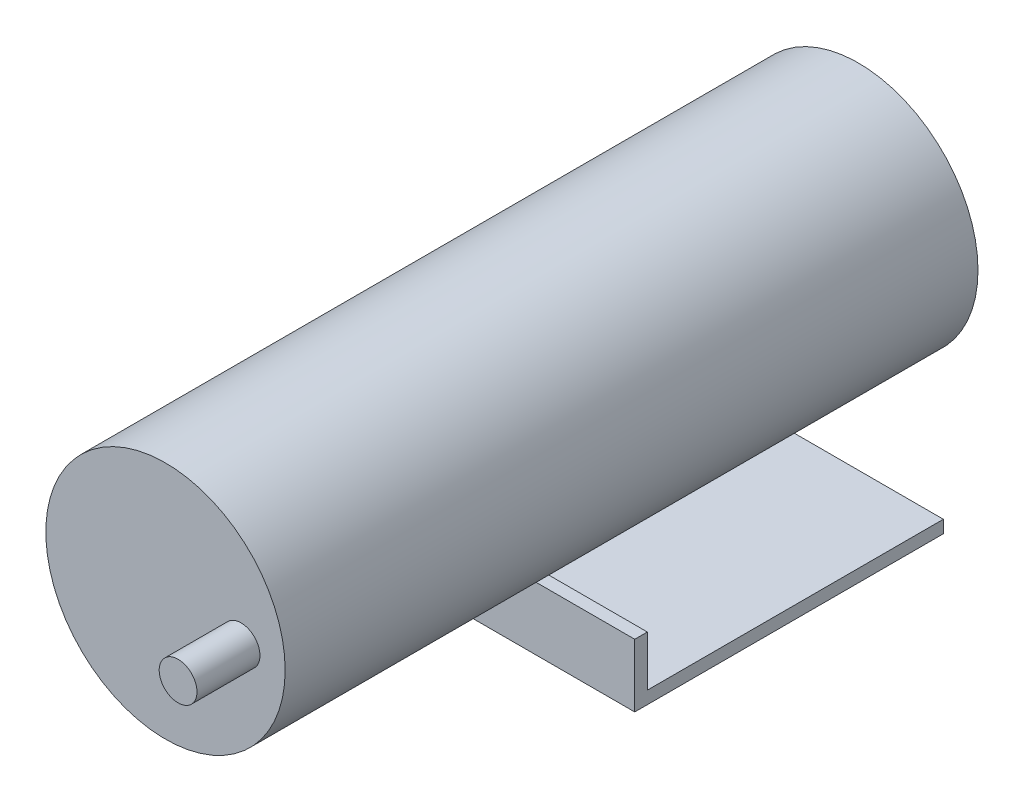
ISO-10303-21;
HEADER;
FILE_DESCRIPTION(('STEP AP214'),'2;1');
FILE_NAME('part.step','',(''),(''),'','','');
FILE_SCHEMA(('AUTOMOTIVE_DESIGN { 1 0 10303 214 1 1 1 1 }'));
ENDSEC;
DATA;
#1=APPLICATION_CONTEXT('core data for automotive mechanical design processes');
#2=APPLICATION_PROTOCOL_DEFINITION('international standard','automotive_design',2000,#1);
#3=PRODUCT_CONTEXT('',#1,'mechanical');
#4=PRODUCT('Part','Part','',(#3));
#5=PRODUCT_RELATED_PRODUCT_CATEGORY('part','',(#4));
#6=PRODUCT_DEFINITION_FORMATION('','',#4);
#7=PRODUCT_DEFINITION_CONTEXT('part definition',#1,'design');
#8=PRODUCT_DEFINITION('design','',#6,#7);
#9=PRODUCT_DEFINITION_SHAPE('','',#8);
#10=(LENGTH_UNIT() NAMED_UNIT(*) SI_UNIT(.MILLI.,.METRE.));
#11=(NAMED_UNIT(*) PLANE_ANGLE_UNIT() SI_UNIT($,.RADIAN.));
#12=(NAMED_UNIT(*) SI_UNIT($,.STERADIAN.) SOLID_ANGLE_UNIT());
#13=UNCERTAINTY_MEASURE_WITH_UNIT(LENGTH_MEASURE(1.E-05),#10,'distance_accuracy_value','');
#14=(GEOMETRIC_REPRESENTATION_CONTEXT(3) GLOBAL_UNCERTAINTY_ASSIGNED_CONTEXT((#13)) GLOBAL_UNIT_ASSIGNED_CONTEXT((#10,
#11,#12)) REPRESENTATION_CONTEXT('',''));
#15=CARTESIAN_POINT('',(0.,0.,0.));
#16=DIRECTION('',(0.,0.,1.));
#17=DIRECTION('',(1.,0.,0.));
#18=AXIS2_PLACEMENT_3D('',#15,#16,#17);
#19=CARTESIAN_POINT('',(23.5,-19.,59.));
#20=DIRECTION('',(0.,-1.,0.));
#21=DIRECTION('',(0.,0.,-1.));
#22=AXIS2_PLACEMENT_3D('',#19,#20,#21);
#23=PLANE('',#22);
#24=DIRECTION('',(-1.,0.,0.));
#25=VECTOR('',#24,1.);
#26=CARTESIAN_POINT('',(23.5,-19.,57.));
#27=LINE('',#26,#25);
#28=CARTESIAN_POINT('',(23.5,-19.,57.));
#29=VERTEX_POINT('',#28);
#30=CARTESIAN_POINT('',(-23.5,-19.,57.));
#31=VERTEX_POINT('',#30);
#32=EDGE_CURVE('E114',#29,#31,#27,.T.);
#33=ORIENTED_EDGE('',*,*,#32,.T.);
#34=DIRECTION('',(0.,0.,1.));
#35=VECTOR('',#34,1.);
#36=CARTESIAN_POINT('',(-23.5,-19.,59.));
#37=LINE('',#36,#35);
#38=CARTESIAN_POINT('',(-23.5,-19.,59.));
#39=VERTEX_POINT('',#38);
#40=EDGE_CURVE('E108',#31,#39,#37,.T.);
#41=ORIENTED_EDGE('',*,*,#40,.T.);
#42=DIRECTION('',(-1.,0.,0.));
#43=VECTOR('',#42,1.);
#44=CARTESIAN_POINT('',(23.5,-19.,59.));
#45=LINE('',#44,#43);
#46=CARTESIAN_POINT('',(23.5,-19.,59.));
#47=VERTEX_POINT('',#46);
#48=EDGE_CURVE('E12',#47,#39,#45,.T.);
#49=ORIENTED_EDGE('',*,*,#48,.F.);
#50=DIRECTION('',(0.,0.,1.));
#51=VECTOR('',#50,1.);
#52=CARTESIAN_POINT('',(23.5,-19.,59.));
#53=LINE('',#52,#51);
#54=EDGE_CURVE('E126',#29,#47,#53,.T.);
#55=ORIENTED_EDGE('',*,*,#54,.F.);
#56=EDGE_LOOP('',(#33,#41,#49,#55));
#57=FACE_BOUND('',#56,.T.);
#58=ADVANCED_FACE('F44',(#57),#23,.F.);
#59=CARTESIAN_POINT('',(23.5,-19.,59.));
#60=DIRECTION('',(0.,0.,-1.));
#61=DIRECTION('',(0.,1.,0.));
#62=AXIS2_PLACEMENT_3D('',#59,#60,#61);
#63=PLANE('',#62);
#64=ORIENTED_EDGE('',*,*,#48,.T.);
#65=DIRECTION('',(0.,-1.,0.));
#66=VECTOR('',#65,1.);
#67=CARTESIAN_POINT('',(-23.5,-19.,59.));
#68=LINE('',#67,#66);
#69=CARTESIAN_POINT('',(-23.5,-29.,59.));
#70=VERTEX_POINT('',#69);
#71=EDGE_CURVE('E98',#39,#70,#68,.T.);
#72=ORIENTED_EDGE('',*,*,#71,.T.);
#73=DIRECTION('',(-1.,0.,0.));
#74=VECTOR('',#73,1.);
#75=CARTESIAN_POINT('',(23.5,-29.,59.));
#76=LINE('',#75,#74);
#77=CARTESIAN_POINT('',(23.5,-29.,59.));
#78=VERTEX_POINT('',#77);
#79=EDGE_CURVE('E51',#78,#70,#76,.T.);
#80=ORIENTED_EDGE('',*,*,#79,.F.);
#81=DIRECTION('',(0.,-1.,0.));
#82=VECTOR('',#81,1.);
#83=CARTESIAN_POINT('',(23.5,-19.,59.));
#84=LINE('',#83,#82);
#85=EDGE_CURVE('E99',#47,#78,#84,.T.);
#86=ORIENTED_EDGE('',*,*,#85,.F.);
#87=EDGE_LOOP('',(#64,#72,#80,#86));
#88=FACE_BOUND('',#87,.T.);
#89=ADVANCED_FACE('F96',(#88),#63,.F.);
#90=CARTESIAN_POINT('',(23.5,-29.,59.));
#91=DIRECTION('',(0.,1.,0.));
#92=DIRECTION('',(0.,0.,1.));
#93=AXIS2_PLACEMENT_3D('',#90,#91,#92);
#94=PLANE('',#93);
#95=ORIENTED_EDGE('',*,*,#79,.T.);
#96=DIRECTION('',(0.,0.,-1.));
#97=VECTOR('',#96,1.);
#98=CARTESIAN_POINT('',(-23.5,-29.,59.));
#99=LINE('',#98,#97);
#100=CARTESIAN_POINT('',(-23.5,-29.,10.));
#101=VERTEX_POINT('',#100);
#102=EDGE_CURVE('E112',#70,#101,#99,.T.);
#103=ORIENTED_EDGE('',*,*,#102,.T.);
#104=DIRECTION('',(-1.,0.,0.));
#105=VECTOR('',#104,1.);
#106=CARTESIAN_POINT('',(23.5,-29.,10.));
#107=LINE('',#106,#105);
#108=CARTESIAN_POINT('',(23.5,-29.,10.));
#109=VERTEX_POINT('',#108);
#110=EDGE_CURVE('E140',#109,#101,#107,.T.);
#111=ORIENTED_EDGE('',*,*,#110,.F.);
#112=DIRECTION('',(0.,0.,-1.));
#113=VECTOR('',#112,1.);
#114=CARTESIAN_POINT('',(23.5,-29.,59.));
#115=LINE('',#114,#113);
#116=EDGE_CURVE('E129',#78,#109,#115,.T.);
#117=ORIENTED_EDGE('',*,*,#116,.F.);
#118=EDGE_LOOP('',(#95,#103,#111,#117));
#119=FACE_BOUND('',#118,.T.);
#120=ADVANCED_FACE('F143',(#119),#94,.F.);
#121=CARTESIAN_POINT('',(23.5,-29.,10.));
#122=DIRECTION('',(0.,0.,1.));
#123=DIRECTION('',(1.,0.,0.));
#124=AXIS2_PLACEMENT_3D('',#121,#122,#123);
#125=PLANE('',#124);
#126=ORIENTED_EDGE('',*,*,#110,.T.);
#127=DIRECTION('',(0.,1.,0.));
#128=VECTOR('',#127,1.);
#129=CARTESIAN_POINT('',(-23.5,-29.,10.));
#130=LINE('',#129,#128);
#131=CARTESIAN_POINT('',(-23.5,-27.,10.));
#132=VERTEX_POINT('',#131);
#133=EDGE_CURVE('E118',#101,#132,#130,.T.);
#134=ORIENTED_EDGE('',*,*,#133,.T.);
#135=DIRECTION('',(-1.,0.,0.));
#136=VECTOR('',#135,1.);
#137=CARTESIAN_POINT('',(23.5,-27.,10.));
#138=LINE('',#137,#136);
#139=CARTESIAN_POINT('',(23.5,-27.,10.));
#140=VERTEX_POINT('',#139);
#141=EDGE_CURVE('E138',#140,#132,#138,.T.);
#142=ORIENTED_EDGE('',*,*,#141,.F.);
#143=DIRECTION('',(0.,1.,0.));
#144=VECTOR('',#143,1.);
#145=CARTESIAN_POINT('',(23.5,-29.,10.));
#146=LINE('',#145,#144);
#147=EDGE_CURVE('E131',#109,#140,#146,.T.);
#148=ORIENTED_EDGE('',*,*,#147,.F.);
#149=EDGE_LOOP('',(#126,#134,#142,#148));
#150=FACE_BOUND('',#149,.T.);
#151=ADVANCED_FACE('F149',(#150),#125,.F.);
#152=CARTESIAN_POINT('',(23.5,-27.,10.));
#153=DIRECTION('',(0.,-1.,0.));
#154=DIRECTION('',(0.,0.,-1.));
#155=AXIS2_PLACEMENT_3D('',#152,#153,#154);
#156=PLANE('',#155);
#157=ORIENTED_EDGE('',*,*,#141,.T.);
#158=DIRECTION('',(0.,0.,1.));
#159=VECTOR('',#158,1.);
#160=CARTESIAN_POINT('',(-23.5,-27.,10.));
#161=LINE('',#160,#159);
#162=CARTESIAN_POINT('',(-23.5,-27.,57.));
#163=VERTEX_POINT('',#162);
#164=EDGE_CURVE('E121',#132,#163,#161,.T.);
#165=ORIENTED_EDGE('',*,*,#164,.T.);
#166=DIRECTION('',(-1.,0.,0.));
#167=VECTOR('',#166,1.);
#168=CARTESIAN_POINT('',(23.5,-27.,57.));
#169=LINE('',#168,#167);
#170=CARTESIAN_POINT('',(23.5,-27.,57.));
#171=VERTEX_POINT('',#170);
#172=EDGE_CURVE('E136',#171,#163,#169,.T.);
#173=ORIENTED_EDGE('',*,*,#172,.F.);
#174=DIRECTION('',(0.,0.,1.));
#175=VECTOR('',#174,1.);
#176=CARTESIAN_POINT('',(23.5,-27.,10.));
#177=LINE('',#176,#175);
#178=EDGE_CURVE('E63',#140,#171,#177,.T.);
#179=ORIENTED_EDGE('',*,*,#178,.F.);
#180=EDGE_LOOP('',(#157,#165,#173,#179));
#181=FACE_BOUND('',#180,.T.);
#182=ADVANCED_FACE('F152',(#181),#156,.F.);
#183=CARTESIAN_POINT('',(23.5,-27.,57.));
#184=DIRECTION('',(0.,0.,1.));
#185=DIRECTION('',(1.,0.,0.));
#186=AXIS2_PLACEMENT_3D('',#183,#184,#185);
#187=PLANE('',#186);
#188=ORIENTED_EDGE('',*,*,#172,.T.);
#189=DIRECTION('',(0.,1.,0.));
#190=VECTOR('',#189,1.);
#191=CARTESIAN_POINT('',(-23.5,-27.,57.));
#192=LINE('',#191,#190);
#193=EDGE_CURVE('E124',#163,#31,#192,.T.);
#194=ORIENTED_EDGE('',*,*,#193,.T.);
#195=ORIENTED_EDGE('',*,*,#32,.F.);
#196=DIRECTION('',(0.,1.,0.));
#197=VECTOR('',#196,1.);
#198=CARTESIAN_POINT('',(23.5,-27.,57.));
#199=LINE('',#198,#197);
#200=EDGE_CURVE('E58',#171,#29,#199,.T.);
#201=ORIENTED_EDGE('',*,*,#200,.F.);
#202=EDGE_LOOP('',(#188,#194,#195,#201));
#203=FACE_BOUND('',#202,.T.);
#204=ADVANCED_FACE('F154',(#203),#187,.F.);
#205=CARTESIAN_POINT('',(23.5,0.,0.));
#206=DIRECTION('',(1.,0.,0.));
#207=DIRECTION('',(0.,0.,-1.));
#208=AXIS2_PLACEMENT_3D('',#205,#206,#207);
#209=PLANE('',#208);
#210=ORIENTED_EDGE('',*,*,#54,.T.);
#211=ORIENTED_EDGE('',*,*,#85,.T.);
#212=ORIENTED_EDGE('',*,*,#116,.T.);
#213=ORIENTED_EDGE('',*,*,#147,.T.);
#214=ORIENTED_EDGE('',*,*,#178,.T.);
#215=ORIENTED_EDGE('',*,*,#200,.T.);
#216=EDGE_LOOP('',(#210,#211,#212,#213,#214,#215));
#217=FACE_BOUND('',#216,.T.);
#218=ADVANCED_FACE('F146',(#217),#209,.T.);
#219=CARTESIAN_POINT('',(-23.5,0.,0.));
#220=DIRECTION('',(1.,0.,0.));
#221=DIRECTION('',(0.,0.,-1.));
#222=AXIS2_PLACEMENT_3D('',#219,#220,#221);
#223=PLANE('',#222);
#224=ORIENTED_EDGE('',*,*,#40,.F.);
#225=ORIENTED_EDGE('',*,*,#193,.F.);
#226=ORIENTED_EDGE('',*,*,#164,.F.);
#227=ORIENTED_EDGE('',*,*,#133,.F.);
#228=ORIENTED_EDGE('',*,*,#102,.F.);
#229=ORIENTED_EDGE('',*,*,#71,.F.);
#230=EDGE_LOOP('',(#224,#225,#226,#227,#228,#229));
#231=FACE_BOUND('',#230,.T.);
#232=ADVANCED_FACE('F106',(#231),#223,.F.);
#233=CLOSED_SHELL('',(#58,#89,#120,#151,#182,#204,#218,#232));
#234=MANIFOLD_SOLID_BREP('B2',#233);
#235=CARTESIAN_POINT('',(0.,0.,110.));
#236=DIRECTION('',(0.,0.,-1.));
#237=DIRECTION('',(-1.,0.,0.));
#238=AXIS2_PLACEMENT_3D('',#235,#236,#237);
#239=CYLINDRICAL_SURFACE('',#238,19.);
#240=CARTESIAN_POINT('',(0.,0.,110.));
#241=DIRECTION('',(0.,0.,1.));
#242=DIRECTION('',(1.,0.,0.));
#243=AXIS2_PLACEMENT_3D('',#240,#241,#242);
#244=CIRCLE('',#243,19.);
#245=CARTESIAN_POINT('',(19.,0.,110.));
#246=VERTEX_POINT('',#245);
#247=EDGE_CURVE('E43',#246,#246,#244,.T.);
#248=ORIENTED_EDGE('',*,*,#247,.F.);
#249=EDGE_LOOP('',(#248));
#250=FACE_BOUND('',#249,.T.);
#251=CARTESIAN_POINT('',(0.,0.,0.));
#252=DIRECTION('',(0.,0.,1.));
#253=DIRECTION('',(1.,0.,0.));
#254=AXIS2_PLACEMENT_3D('',#251,#252,#253);
#255=CIRCLE('',#254,19.);
#256=CARTESIAN_POINT('',(19.,0.,0.));
#257=VERTEX_POINT('',#256);
#258=EDGE_CURVE('E222',#257,#257,#255,.T.);
#259=ORIENTED_EDGE('',*,*,#258,.T.);
#260=EDGE_LOOP('',(#259));
#261=FACE_BOUND('',#260,.T.);
#262=ADVANCED_FACE('F219',(#250,#261),#239,.T.);
#263=CARTESIAN_POINT('',(0.,0.,110.));
#264=DIRECTION('',(0.,0.,1.));
#265=DIRECTION('',(1.,0.,0.));
#266=AXIS2_PLACEMENT_3D('',#263,#264,#265);
#267=PLANE('',#266);
#268=CARTESIAN_POINT('',(12.,0.,110.));
#269=DIRECTION('',(0.,0.,1.));
#270=DIRECTION('',(1.,0.,0.));
#271=AXIS2_PLACEMENT_3D('',#268,#269,#270);
#272=CIRCLE('',#271,3.);
#273=CARTESIAN_POINT('',(15.,0.,110.));
#274=VERTEX_POINT('',#273);
#275=EDGE_CURVE('E231',#274,#274,#272,.T.);
#276=ORIENTED_EDGE('',*,*,#275,.F.);
#277=EDGE_LOOP('',(#276));
#278=FACE_BOUND('',#277,.T.);
#279=ORIENTED_EDGE('',*,*,#247,.T.);
#280=EDGE_LOOP('',(#279));
#281=FACE_BOUND('',#280,.T.);
#282=ADVANCED_FACE('F246',(#278,#281),#267,.T.);
#283=CARTESIAN_POINT('',(0.,0.,0.));
#284=DIRECTION('',(0.,0.,1.));
#285=DIRECTION('',(1.,0.,0.));
#286=AXIS2_PLACEMENT_3D('',#283,#284,#285);
#287=PLANE('',#286);
#288=ORIENTED_EDGE('',*,*,#258,.F.);
#289=EDGE_LOOP('',(#288));
#290=FACE_BOUND('',#289,.T.);
#291=ADVANCED_FACE('F242',(#290),#287,.F.);
#292=CARTESIAN_POINT('',(12.,0.,120.));
#293=DIRECTION('',(0.,0.,-1.));
#294=DIRECTION('',(-1.,0.,0.));
#295=AXIS2_PLACEMENT_3D('',#292,#293,#294);
#296=CYLINDRICAL_SURFACE('',#295,3.);
#297=CARTESIAN_POINT('',(12.,0.,120.));
#298=DIRECTION('',(0.,0.,1.));
#299=DIRECTION('',(1.,0.,0.));
#300=AXIS2_PLACEMENT_3D('',#297,#298,#299);
#301=CIRCLE('',#300,3.);
#302=CARTESIAN_POINT('',(15.,0.,120.));
#303=VERTEX_POINT('',#302);
#304=EDGE_CURVE('E229',#303,#303,#301,.T.);
#305=ORIENTED_EDGE('',*,*,#304,.F.);
#306=EDGE_LOOP('',(#305));
#307=FACE_BOUND('',#306,.T.);
#308=ORIENTED_EDGE('',*,*,#275,.T.);
#309=EDGE_LOOP('',(#308));
#310=FACE_BOUND('',#309,.T.);
#311=ADVANCED_FACE('F239',(#307,#310),#296,.T.);
#312=CARTESIAN_POINT('',(12.,0.,120.));
#313=DIRECTION('',(0.,0.,1.));
#314=DIRECTION('',(1.,0.,0.));
#315=AXIS2_PLACEMENT_3D('',#312,#313,#314);
#316=PLANE('',#315);
#317=ORIENTED_EDGE('',*,*,#304,.T.);
#318=EDGE_LOOP('',(#317));
#319=FACE_BOUND('',#318,.T.);
#320=ADVANCED_FACE('F237',(#319),#316,.T.);
#321=CLOSED_SHELL('',(#262,#282,#291,#311,#320));
#322=MANIFOLD_SOLID_BREP('B6',#321);
#323=ADVANCED_BREP_SHAPE_REPRESENTATION('',(#18,#234,#322),#14);
#324=SHAPE_DEFINITION_REPRESENTATION(#9,#323);
ENDSEC;
END-ISO-10303-21;
